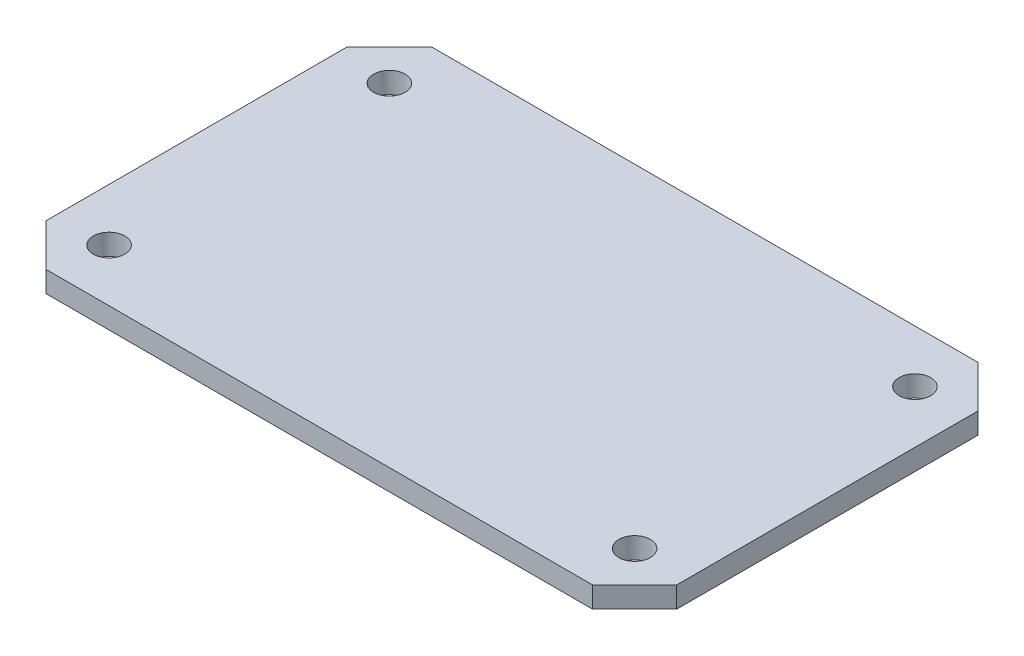
ISO-10303-21;
HEADER;
FILE_DESCRIPTION(('STEP AP214'),'2;1');
FILE_NAME('part.step','',(''),(''),'','','');
FILE_SCHEMA(('AUTOMOTIVE_DESIGN { 1 0 10303 214 1 1 1 1 }'));
ENDSEC;
DATA;
#1=APPLICATION_CONTEXT('core data for automotive mechanical design processes');
#2=APPLICATION_PROTOCOL_DEFINITION('international standard','automotive_design',2000,#1);
#3=PRODUCT_CONTEXT('',#1,'mechanical');
#4=PRODUCT('Part','Part','',(#3));
#5=PRODUCT_RELATED_PRODUCT_CATEGORY('part','',(#4));
#6=PRODUCT_DEFINITION_FORMATION('','',#4);
#7=PRODUCT_DEFINITION_CONTEXT('part definition',#1,'design');
#8=PRODUCT_DEFINITION('design','',#6,#7);
#9=PRODUCT_DEFINITION_SHAPE('','',#8);
#10=(LENGTH_UNIT() NAMED_UNIT(*) SI_UNIT(.MILLI.,.METRE.));
#11=(NAMED_UNIT(*) PLANE_ANGLE_UNIT() SI_UNIT($,.RADIAN.));
#12=(NAMED_UNIT(*) SI_UNIT($,.STERADIAN.) SOLID_ANGLE_UNIT());
#13=UNCERTAINTY_MEASURE_WITH_UNIT(LENGTH_MEASURE(1.E-05),#10,'distance_accuracy_value','');
#14=(GEOMETRIC_REPRESENTATION_CONTEXT(3) GLOBAL_UNCERTAINTY_ASSIGNED_CONTEXT((#13)) GLOBAL_UNIT_ASSIGNED_CONTEXT((#10,
#11,#12)) REPRESENTATION_CONTEXT('',''));
#15=CARTESIAN_POINT('',(0.,0.,0.));
#16=DIRECTION('',(0.,0.,1.));
#17=DIRECTION('',(1.,0.,0.));
#18=AXIS2_PLACEMENT_3D('',#15,#16,#17);
#19=CARTESIAN_POINT('',(-45.,19.,0.));
#20=DIRECTION('',(1.,0.,0.));
#21=DIRECTION('',(0.,0.,-1.));
#22=AXIS2_PLACEMENT_3D('',#19,#20,#21);
#23=PLANE('',#22);
#24=DIRECTION('',(0.,0.,1.));
#25=VECTOR('',#24,1.);
#26=CARTESIAN_POINT('',(-45.,16.,0.));
#27=LINE('',#26,#25);
#28=CARTESIAN_POINT('',(-45.,16.,-21.5));
#29=VERTEX_POINT('',#28);
#30=CARTESIAN_POINT('',(-45.,16.,21.5));
#31=VERTEX_POINT('',#30);
#32=EDGE_CURVE('E144',#29,#31,#27,.T.);
#33=ORIENTED_EDGE('',*,*,#32,.T.);
#34=DIRECTION('',(0.,-1.,0.));
#35=VECTOR('',#34,1.);
#36=CARTESIAN_POINT('',(-45.,19.,21.5));
#37=LINE('',#36,#35);
#38=CARTESIAN_POINT('',(-45.,19.,21.5));
#39=VERTEX_POINT('',#38);
#40=EDGE_CURVE('E11',#39,#31,#37,.T.);
#41=ORIENTED_EDGE('',*,*,#40,.F.);
#42=DIRECTION('',(0.,0.,1.));
#43=VECTOR('',#42,1.);
#44=CARTESIAN_POINT('',(-45.,19.,0.));
#45=LINE('',#44,#43);
#46=CARTESIAN_POINT('',(-45.,19.,-21.5));
#47=VERTEX_POINT('',#46);
#48=EDGE_CURVE('E170',#47,#39,#45,.T.);
#49=ORIENTED_EDGE('',*,*,#48,.F.);
#50=DIRECTION('',(0.,-1.,0.));
#51=VECTOR('',#50,1.);
#52=CARTESIAN_POINT('',(-45.,19.,-21.5));
#53=LINE('',#52,#51);
#54=EDGE_CURVE('E143',#47,#29,#53,.T.);
#55=ORIENTED_EDGE('',*,*,#54,.T.);
#56=EDGE_LOOP('',(#33,#41,#49,#55));
#57=FACE_BOUND('',#56,.T.);
#58=ADVANCED_FACE('F35',(#57),#23,.F.);
#59=CARTESIAN_POINT('',(-33.25,19.,33.25));
#60=DIRECTION('',(0.707106781186548,0.,-0.707106781186547));
#61=DIRECTION('',(-0.707106781186547,0.,-0.707106781186548));
#62=AXIS2_PLACEMENT_3D('',#59,#60,#61);
#63=PLANE('',#62);
#64=DIRECTION('',(0.707106781186547,0.,0.707106781186548));
#65=VECTOR('',#64,1.);
#66=CARTESIAN_POINT('',(-33.25,16.,33.25));
#67=LINE('',#66,#65);
#68=CARTESIAN_POINT('',(-39.,16.,27.5));
#69=VERTEX_POINT('',#68);
#70=EDGE_CURVE('E147',#31,#69,#67,.T.);
#71=ORIENTED_EDGE('',*,*,#70,.T.);
#72=DIRECTION('',(0.,-1.,0.));
#73=VECTOR('',#72,1.);
#74=CARTESIAN_POINT('',(-39.,19.,27.5));
#75=LINE('',#74,#73);
#76=CARTESIAN_POINT('',(-39.,19.,27.5));
#77=VERTEX_POINT('',#76);
#78=EDGE_CURVE('E43',#77,#69,#75,.T.);
#79=ORIENTED_EDGE('',*,*,#78,.F.);
#80=DIRECTION('',(0.707106781186547,0.,0.707106781186548));
#81=VECTOR('',#80,1.);
#82=CARTESIAN_POINT('',(-33.25,19.,33.25));
#83=LINE('',#82,#81);
#84=EDGE_CURVE('E94',#39,#77,#83,.T.);
#85=ORIENTED_EDGE('',*,*,#84,.F.);
#86=ORIENTED_EDGE('',*,*,#40,.T.);
#87=EDGE_LOOP('',(#71,#79,#85,#86));
#88=FACE_BOUND('',#87,.T.);
#89=ADVANCED_FACE('F206',(#88),#63,.F.);
#90=CARTESIAN_POINT('',(0.,19.,27.5));
#91=DIRECTION('',(0.,0.,-1.));
#92=DIRECTION('',(-1.,0.,0.));
#93=AXIS2_PLACEMENT_3D('',#90,#91,#92);
#94=PLANE('',#93);
#95=DIRECTION('',(1.,0.,0.));
#96=VECTOR('',#95,1.);
#97=CARTESIAN_POINT('',(0.,16.,27.5));
#98=LINE('',#97,#96);
#99=CARTESIAN_POINT('',(39.,16.,27.5));
#100=VERTEX_POINT('',#99);
#101=EDGE_CURVE('E149',#69,#100,#98,.T.);
#102=ORIENTED_EDGE('',*,*,#101,.T.);
#103=DIRECTION('',(0.,-1.,0.));
#104=VECTOR('',#103,1.);
#105=CARTESIAN_POINT('',(39.,19.,27.5));
#106=LINE('',#105,#104);
#107=CARTESIAN_POINT('',(39.,19.,27.5));
#108=VERTEX_POINT('',#107);
#109=EDGE_CURVE('E177',#108,#100,#106,.T.);
#110=ORIENTED_EDGE('',*,*,#109,.F.);
#111=DIRECTION('',(1.,0.,0.));
#112=VECTOR('',#111,1.);
#113=CARTESIAN_POINT('',(0.,19.,27.5));
#114=LINE('',#113,#112);
#115=EDGE_CURVE('E185',#77,#108,#114,.T.);
#116=ORIENTED_EDGE('',*,*,#115,.F.);
#117=ORIENTED_EDGE('',*,*,#78,.T.);
#118=EDGE_LOOP('',(#102,#110,#116,#117));
#119=FACE_BOUND('',#118,.T.);
#120=ADVANCED_FACE('F183',(#119),#94,.F.);
#121=CARTESIAN_POINT('',(33.2499999999999,19.,33.25));
#122=DIRECTION('',(-0.707106781186547,0.,-0.707106781186548));
#123=DIRECTION('',(-0.707106781186548,0.,0.707106781186547));
#124=AXIS2_PLACEMENT_3D('',#121,#122,#123);
#125=PLANE('',#124);
#126=DIRECTION('',(0.707106781186548,0.,-0.707106781186547));
#127=VECTOR('',#126,1.);
#128=CARTESIAN_POINT('',(33.2499999999999,16.,33.25));
#129=LINE('',#128,#127);
#130=CARTESIAN_POINT('',(45.,16.,21.5));
#131=VERTEX_POINT('',#130);
#132=EDGE_CURVE('E151',#100,#131,#129,.T.);
#133=ORIENTED_EDGE('',*,*,#132,.T.);
#134=DIRECTION('',(0.,-1.,0.));
#135=VECTOR('',#134,1.);
#136=CARTESIAN_POINT('',(45.,19.,21.5));
#137=LINE('',#136,#135);
#138=CARTESIAN_POINT('',(45.,19.,21.5));
#139=VERTEX_POINT('',#138);
#140=EDGE_CURVE('E174',#139,#131,#137,.T.);
#141=ORIENTED_EDGE('',*,*,#140,.F.);
#142=DIRECTION('',(0.707106781186548,0.,-0.707106781186547));
#143=VECTOR('',#142,1.);
#144=CARTESIAN_POINT('',(33.2499999999999,19.,33.25));
#145=LINE('',#144,#143);
#146=EDGE_CURVE('E198',#108,#139,#145,.T.);
#147=ORIENTED_EDGE('',*,*,#146,.F.);
#148=ORIENTED_EDGE('',*,*,#109,.T.);
#149=EDGE_LOOP('',(#133,#141,#147,#148));
#150=FACE_BOUND('',#149,.T.);
#151=ADVANCED_FACE('F194',(#150),#125,.F.);
#152=CARTESIAN_POINT('',(45.,19.,0.));
#153=DIRECTION('',(-1.,0.,0.));
#154=DIRECTION('',(0.,0.,1.));
#155=AXIS2_PLACEMENT_3D('',#152,#153,#154);
#156=PLANE('',#155);
#157=DIRECTION('',(0.,0.,-1.));
#158=VECTOR('',#157,1.);
#159=CARTESIAN_POINT('',(45.,16.,0.));
#160=LINE('',#159,#158);
#161=CARTESIAN_POINT('',(45.,16.,-21.5));
#162=VERTEX_POINT('',#161);
#163=EDGE_CURVE('E153',#131,#162,#160,.T.);
#164=ORIENTED_EDGE('',*,*,#163,.T.);
#165=DIRECTION('',(0.,-1.,0.));
#166=VECTOR('',#165,1.);
#167=CARTESIAN_POINT('',(45.,19.,-21.5));
#168=LINE('',#167,#166);
#169=CARTESIAN_POINT('',(45.,19.,-21.5));
#170=VERTEX_POINT('',#169);
#171=EDGE_CURVE('E123',#170,#162,#168,.T.);
#172=ORIENTED_EDGE('',*,*,#171,.F.);
#173=DIRECTION('',(0.,0.,-1.));
#174=VECTOR('',#173,1.);
#175=CARTESIAN_POINT('',(45.,19.,0.));
#176=LINE('',#175,#174);
#177=EDGE_CURVE('E114',#139,#170,#176,.T.);
#178=ORIENTED_EDGE('',*,*,#177,.F.);
#179=ORIENTED_EDGE('',*,*,#140,.T.);
#180=EDGE_LOOP('',(#164,#172,#178,#179));
#181=FACE_BOUND('',#180,.T.);
#182=ADVANCED_FACE('F197',(#181),#156,.F.);
#183=CARTESIAN_POINT('',(33.25,19.,-33.25));
#184=DIRECTION('',(-0.707106781186548,0.,0.707106781186547));
#185=DIRECTION('',(0.707106781186547,0.,0.707106781186548));
#186=AXIS2_PLACEMENT_3D('',#183,#184,#185);
#187=PLANE('',#186);
#188=DIRECTION('',(-0.707106781186547,0.,-0.707106781186548));
#189=VECTOR('',#188,1.);
#190=CARTESIAN_POINT('',(33.25,16.,-33.25));
#191=LINE('',#190,#189);
#192=CARTESIAN_POINT('',(38.9999999999999,16.,-27.5));
#193=VERTEX_POINT('',#192);
#194=EDGE_CURVE('E122',#162,#193,#191,.T.);
#195=ORIENTED_EDGE('',*,*,#194,.T.);
#196=DIRECTION('',(0.,-1.,0.));
#197=VECTOR('',#196,1.);
#198=CARTESIAN_POINT('',(38.9999999999999,19.,-27.5));
#199=LINE('',#198,#197);
#200=CARTESIAN_POINT('',(38.9999999999999,19.,-27.5));
#201=VERTEX_POINT('',#200);
#202=EDGE_CURVE('E119',#201,#193,#199,.T.);
#203=ORIENTED_EDGE('',*,*,#202,.F.);
#204=DIRECTION('',(-0.707106781186547,0.,-0.707106781186548));
#205=VECTOR('',#204,1.);
#206=CARTESIAN_POINT('',(33.25,19.,-33.25));
#207=LINE('',#206,#205);
#208=EDGE_CURVE('E107',#170,#201,#207,.T.);
#209=ORIENTED_EDGE('',*,*,#208,.F.);
#210=ORIENTED_EDGE('',*,*,#171,.T.);
#211=EDGE_LOOP('',(#195,#203,#209,#210));
#212=FACE_BOUND('',#211,.T.);
#213=ADVANCED_FACE('F120',(#212),#187,.F.);
#214=CARTESIAN_POINT('',(0.,19.,-27.5));
#215=DIRECTION('',(0.,0.,1.));
#216=DIRECTION('',(1.,0.,0.));
#217=AXIS2_PLACEMENT_3D('',#214,#215,#216);
#218=PLANE('',#217);
#219=DIRECTION('',(-1.,0.,0.));
#220=VECTOR('',#219,1.);
#221=CARTESIAN_POINT('',(0.,16.,-27.5));
#222=LINE('',#221,#220);
#223=CARTESIAN_POINT('',(-39.,16.,-27.5));
#224=VERTEX_POINT('',#223);
#225=EDGE_CURVE('E80',#193,#224,#222,.T.);
#226=ORIENTED_EDGE('',*,*,#225,.T.);
#227=DIRECTION('',(0.,-1.,0.));
#228=VECTOR('',#227,1.);
#229=CARTESIAN_POINT('',(-39.,19.,-27.5));
#230=LINE('',#229,#228);
#231=CARTESIAN_POINT('',(-39.,19.,-27.5));
#232=VERTEX_POINT('',#231);
#233=EDGE_CURVE('E124',#232,#224,#230,.T.);
#234=ORIENTED_EDGE('',*,*,#233,.F.);
#235=DIRECTION('',(-1.,0.,0.));
#236=VECTOR('',#235,1.);
#237=CARTESIAN_POINT('',(0.,19.,-27.5));
#238=LINE('',#237,#236);
#239=EDGE_CURVE('E112',#201,#232,#238,.T.);
#240=ORIENTED_EDGE('',*,*,#239,.F.);
#241=ORIENTED_EDGE('',*,*,#202,.T.);
#242=EDGE_LOOP('',(#226,#234,#240,#241));
#243=FACE_BOUND('',#242,.T.);
#244=ADVANCED_FACE('F126',(#243),#218,.F.);
#245=CARTESIAN_POINT('',(37.5,19.,-20.));
#246=DIRECTION('',(0.,-1.,0.));
#247=DIRECTION('',(0.,0.,-1.));
#248=AXIS2_PLACEMENT_3D('',#245,#246,#247);
#249=CYLINDRICAL_SURFACE('',#248,2.24999999999999);
#250=CARTESIAN_POINT('',(37.5,19.,-20.));
#251=DIRECTION('',(0.,1.,0.));
#252=DIRECTION('',(0.,0.,1.));
#253=AXIS2_PLACEMENT_3D('',#250,#251,#252);
#254=CIRCLE('',#253,2.24999999999999);
#255=CARTESIAN_POINT('',(37.5,19.,-17.75));
#256=VERTEX_POINT('',#255);
#257=EDGE_CURVE('E137',#256,#256,#254,.F.);
#258=ORIENTED_EDGE('',*,*,#257,.F.);
#259=EDGE_LOOP('',(#258));
#260=FACE_BOUND('',#259,.T.);
#261=CARTESIAN_POINT('',(37.5,16.,-20.));
#262=DIRECTION('',(0.,1.,0.));
#263=DIRECTION('',(0.,0.,1.));
#264=AXIS2_PLACEMENT_3D('',#261,#262,#263);
#265=CIRCLE('',#264,2.24999999999999);
#266=CARTESIAN_POINT('',(37.5,16.,-17.75));
#267=VERTEX_POINT('',#266);
#268=EDGE_CURVE('E164',#267,#267,#265,.F.);
#269=ORIENTED_EDGE('',*,*,#268,.T.);
#270=EDGE_LOOP('',(#269));
#271=FACE_BOUND('',#270,.T.);
#272=ADVANCED_FACE('F222',(#260,#271),#249,.F.);
#273=CARTESIAN_POINT('',(-37.5,19.,20.));
#274=DIRECTION('',(0.,-1.,0.));
#275=DIRECTION('',(0.,0.,-1.));
#276=AXIS2_PLACEMENT_3D('',#273,#274,#275);
#277=CYLINDRICAL_SURFACE('',#276,2.24999999999999);
#278=CARTESIAN_POINT('',(-37.5,19.,20.));
#279=DIRECTION('',(0.,1.,0.));
#280=DIRECTION('',(0.,0.,1.));
#281=AXIS2_PLACEMENT_3D('',#278,#279,#280);
#282=CIRCLE('',#281,2.24999999999999);
#283=CARTESIAN_POINT('',(-37.5,19.,22.25));
#284=VERTEX_POINT('',#283);
#285=EDGE_CURVE('E134',#284,#284,#282,.F.);
#286=ORIENTED_EDGE('',*,*,#285,.F.);
#287=EDGE_LOOP('',(#286));
#288=FACE_BOUND('',#287,.T.);
#289=CARTESIAN_POINT('',(-37.5,16.,20.));
#290=DIRECTION('',(0.,1.,0.));
#291=DIRECTION('',(0.,0.,1.));
#292=AXIS2_PLACEMENT_3D('',#289,#290,#291);
#293=CIRCLE('',#292,2.24999999999999);
#294=CARTESIAN_POINT('',(-37.5,16.,22.25));
#295=VERTEX_POINT('',#294);
#296=EDGE_CURVE('E161',#295,#295,#293,.F.);
#297=ORIENTED_EDGE('',*,*,#296,.T.);
#298=EDGE_LOOP('',(#297));
#299=FACE_BOUND('',#298,.T.);
#300=ADVANCED_FACE('F230',(#288,#299),#277,.F.);
#301=CARTESIAN_POINT('',(37.5,19.,20.));
#302=DIRECTION('',(0.,-1.,0.));
#303=DIRECTION('',(0.,0.,-1.));
#304=AXIS2_PLACEMENT_3D('',#301,#302,#303);
#305=CYLINDRICAL_SURFACE('',#304,2.24999999999999);
#306=CARTESIAN_POINT('',(37.5,19.,20.));
#307=DIRECTION('',(0.,1.,0.));
#308=DIRECTION('',(0.,0.,1.));
#309=AXIS2_PLACEMENT_3D('',#306,#307,#308);
#310=CIRCLE('',#309,2.24999999999999);
#311=CARTESIAN_POINT('',(37.5,19.,22.25));
#312=VERTEX_POINT('',#311);
#313=EDGE_CURVE('E128',#312,#312,#310,.F.);
#314=ORIENTED_EDGE('',*,*,#313,.F.);
#315=EDGE_LOOP('',(#314));
#316=FACE_BOUND('',#315,.T.);
#317=CARTESIAN_POINT('',(37.5,16.,20.));
#318=DIRECTION('',(0.,1.,0.));
#319=DIRECTION('',(0.,0.,1.));
#320=AXIS2_PLACEMENT_3D('',#317,#318,#319);
#321=CIRCLE('',#320,2.24999999999999);
#322=CARTESIAN_POINT('',(37.5,16.,22.25));
#323=VERTEX_POINT('',#322);
#324=EDGE_CURVE('E158',#323,#323,#321,.F.);
#325=ORIENTED_EDGE('',*,*,#324,.T.);
#326=EDGE_LOOP('',(#325));
#327=FACE_BOUND('',#326,.T.);
#328=ADVANCED_FACE('F227',(#316,#327),#305,.F.);
#329=CARTESIAN_POINT('',(-33.25,19.,-33.25));
#330=DIRECTION('',(0.707106781186547,0.,0.707106781186548));
#331=DIRECTION('',(0.707106781186548,0.,-0.707106781186547));
#332=AXIS2_PLACEMENT_3D('',#329,#330,#331);
#333=PLANE('',#332);
#334=DIRECTION('',(-0.707106781186548,0.,0.707106781186547));
#335=VECTOR('',#334,1.);
#336=CARTESIAN_POINT('',(-33.25,16.,-33.25));
#337=LINE('',#336,#335);
#338=EDGE_CURVE('E86',#224,#29,#337,.T.);
#339=ORIENTED_EDGE('',*,*,#338,.T.);
#340=ORIENTED_EDGE('',*,*,#54,.F.);
#341=DIRECTION('',(-0.707106781186548,0.,0.707106781186547));
#342=VECTOR('',#341,1.);
#343=CARTESIAN_POINT('',(-33.25,19.,-33.25));
#344=LINE('',#343,#342);
#345=EDGE_CURVE('E51',#232,#47,#344,.T.);
#346=ORIENTED_EDGE('',*,*,#345,.F.);
#347=ORIENTED_EDGE('',*,*,#233,.T.);
#348=EDGE_LOOP('',(#339,#340,#346,#347));
#349=FACE_BOUND('',#348,.T.);
#350=ADVANCED_FACE('F223',(#349),#333,.F.);
#351=CARTESIAN_POINT('',(-37.5,19.,-20.));
#352=DIRECTION('',(0.,-1.,0.));
#353=DIRECTION('',(0.,0.,-1.));
#354=AXIS2_PLACEMENT_3D('',#351,#352,#353);
#355=CYLINDRICAL_SURFACE('',#354,2.24999999999999);
#356=CARTESIAN_POINT('',(-37.5,19.,-20.));
#357=DIRECTION('',(0.,1.,0.));
#358=DIRECTION('',(0.,0.,1.));
#359=AXIS2_PLACEMENT_3D('',#356,#357,#358);
#360=CIRCLE('',#359,2.24999999999999);
#361=CARTESIAN_POINT('',(-37.5,19.,-17.75));
#362=VERTEX_POINT('',#361);
#363=EDGE_CURVE('E140',#362,#362,#360,.F.);
#364=ORIENTED_EDGE('',*,*,#363,.F.);
#365=EDGE_LOOP('',(#364));
#366=FACE_BOUND('',#365,.T.);
#367=CARTESIAN_POINT('',(-37.5,16.,-20.));
#368=DIRECTION('',(0.,1.,0.));
#369=DIRECTION('',(0.,0.,1.));
#370=AXIS2_PLACEMENT_3D('',#367,#368,#369);
#371=CIRCLE('',#370,2.24999999999999);
#372=CARTESIAN_POINT('',(-37.5,16.,-17.75));
#373=VERTEX_POINT('',#372);
#374=EDGE_CURVE('E167',#373,#373,#371,.F.);
#375=ORIENTED_EDGE('',*,*,#374,.T.);
#376=EDGE_LOOP('',(#375));
#377=FACE_BOUND('',#376,.T.);
#378=ADVANCED_FACE('F226',(#366,#377),#355,.F.);
#379=CARTESIAN_POINT('',(0.,19.,0.));
#380=DIRECTION('',(0.,1.,0.));
#381=DIRECTION('',(0.,0.,1.));
#382=AXIS2_PLACEMENT_3D('',#379,#380,#381);
#383=PLANE('',#382);
#384=ORIENTED_EDGE('',*,*,#48,.T.);
#385=ORIENTED_EDGE('',*,*,#84,.T.);
#386=ORIENTED_EDGE('',*,*,#115,.T.);
#387=ORIENTED_EDGE('',*,*,#146,.T.);
#388=ORIENTED_EDGE('',*,*,#177,.T.);
#389=ORIENTED_EDGE('',*,*,#208,.T.);
#390=ORIENTED_EDGE('',*,*,#239,.T.);
#391=ORIENTED_EDGE('',*,*,#345,.T.);
#392=EDGE_LOOP('',(#384,#385,#386,#387,#388,#389,#390,#391));
#393=FACE_BOUND('',#392,.T.);
#394=ORIENTED_EDGE('',*,*,#313,.T.);
#395=EDGE_LOOP('',(#394));
#396=FACE_BOUND('',#395,.T.);
#397=ORIENTED_EDGE('',*,*,#285,.T.);
#398=EDGE_LOOP('',(#397));
#399=FACE_BOUND('',#398,.T.);
#400=ORIENTED_EDGE('',*,*,#257,.T.);
#401=EDGE_LOOP('',(#400));
#402=FACE_BOUND('',#401,.T.);
#403=ORIENTED_EDGE('',*,*,#363,.T.);
#404=EDGE_LOOP('',(#403));
#405=FACE_BOUND('',#404,.T.);
#406=ADVANCED_FACE('F109',(#393,#396,#399,#402,#405),#383,.T.);
#407=CARTESIAN_POINT('',(0.,16.,0.));
#408=DIRECTION('',(0.,1.,0.));
#409=DIRECTION('',(0.,0.,1.));
#410=AXIS2_PLACEMENT_3D('',#407,#408,#409);
#411=PLANE('',#410);
#412=ORIENTED_EDGE('',*,*,#32,.F.);
#413=ORIENTED_EDGE('',*,*,#338,.F.);
#414=ORIENTED_EDGE('',*,*,#225,.F.);
#415=ORIENTED_EDGE('',*,*,#194,.F.);
#416=ORIENTED_EDGE('',*,*,#163,.F.);
#417=ORIENTED_EDGE('',*,*,#132,.F.);
#418=ORIENTED_EDGE('',*,*,#101,.F.);
#419=ORIENTED_EDGE('',*,*,#70,.F.);
#420=EDGE_LOOP('',(#412,#413,#414,#415,#416,#417,#418,#419));
#421=FACE_BOUND('',#420,.T.);
#422=ORIENTED_EDGE('',*,*,#324,.F.);
#423=EDGE_LOOP('',(#422));
#424=FACE_BOUND('',#423,.T.);
#425=ORIENTED_EDGE('',*,*,#296,.F.);
#426=EDGE_LOOP('',(#425));
#427=FACE_BOUND('',#426,.T.);
#428=ORIENTED_EDGE('',*,*,#268,.F.);
#429=EDGE_LOOP('',(#428));
#430=FACE_BOUND('',#429,.T.);
#431=ORIENTED_EDGE('',*,*,#374,.F.);
#432=EDGE_LOOP('',(#431));
#433=FACE_BOUND('',#432,.T.);
#434=ADVANCED_FACE('F189',(#421,#424,#427,#430,#433),#411,.F.);
#435=CLOSED_SHELL('',(#58,#89,#120,#151,#182,#213,#244,#272,#300,#328,#350,#378,#406,#434));
#436=MANIFOLD_SOLID_BREP('B2',#435);
#437=ADVANCED_BREP_SHAPE_REPRESENTATION('',(#18,#436),#14);
#438=SHAPE_DEFINITION_REPRESENTATION(#9,#437);
ENDSEC;
END-ISO-10303-21;
